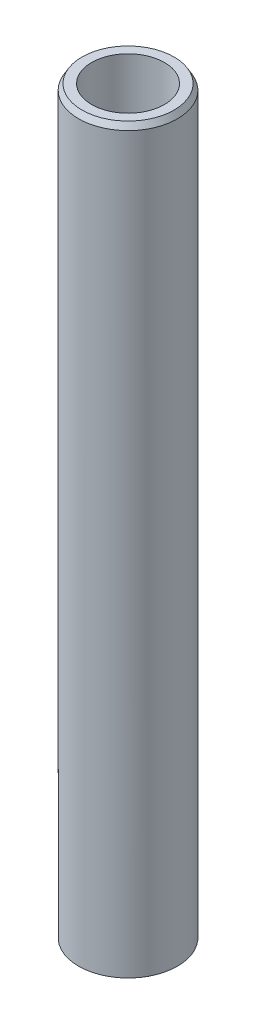
ISO-10303-21;
HEADER;
FILE_DESCRIPTION(('STEP AP214'),'2;1');
FILE_NAME('part.step','',(''),(''),'','','');
FILE_SCHEMA(('AUTOMOTIVE_DESIGN { 1 0 10303 214 1 1 1 1 }'));
ENDSEC;
DATA;
#1=APPLICATION_CONTEXT('core data for automotive mechanical design processes');
#2=APPLICATION_PROTOCOL_DEFINITION('international standard','automotive_design',2000,#1);
#3=PRODUCT_CONTEXT('',#1,'mechanical');
#4=PRODUCT('Part','Part','',(#3));
#5=PRODUCT_RELATED_PRODUCT_CATEGORY('part','',(#4));
#6=PRODUCT_DEFINITION_FORMATION('','',#4);
#7=PRODUCT_DEFINITION_CONTEXT('part definition',#1,'design');
#8=PRODUCT_DEFINITION('design','',#6,#7);
#9=PRODUCT_DEFINITION_SHAPE('','',#8);
#10=(LENGTH_UNIT() NAMED_UNIT(*) SI_UNIT(.MILLI.,.METRE.));
#11=(NAMED_UNIT(*) PLANE_ANGLE_UNIT() SI_UNIT($,.RADIAN.));
#12=(NAMED_UNIT(*) SI_UNIT($,.STERADIAN.) SOLID_ANGLE_UNIT());
#13=UNCERTAINTY_MEASURE_WITH_UNIT(LENGTH_MEASURE(1.E-05),#10,'distance_accuracy_value','');
#14=(GEOMETRIC_REPRESENTATION_CONTEXT(3) GLOBAL_UNCERTAINTY_ASSIGNED_CONTEXT((#13)) GLOBAL_UNIT_ASSIGNED_CONTEXT((#10,
#11,#12)) REPRESENTATION_CONTEXT('',''));
#15=CARTESIAN_POINT('',(0.,0.,0.));
#16=DIRECTION('',(0.,0.,1.));
#17=DIRECTION('',(1.,0.,0.));
#18=AXIS2_PLACEMENT_3D('',#15,#16,#17);
#19=CARTESIAN_POINT('',(0.,375.960972460126,0.));
#20=DIRECTION('',(0.,-1.,0.));
#21=DIRECTION('',(0.,0.,-1.));
#22=AXIS2_PLACEMENT_3D('',#19,#20,#21);
#23=CYLINDRICAL_SURFACE('',#22,25.);
#24=CARTESIAN_POINT('',(0.,372.987151396493,0.));
#25=DIRECTION('',(0.,1.,0.));
#26=DIRECTION('',(0.,0.,1.));
#27=AXIS2_PLACEMENT_3D('',#24,#25,#26);
#28=CIRCLE('',#27,25.);
#29=CARTESIAN_POINT('',(0.,372.987151396493,-25.));
#30=VERTEX_POINT('',#29);
#31=EDGE_CURVE('E50',#30,#30,#28,.F.);
#32=CARTESIAN_POINT('',(0.,1.71693639161058,0.));
#33=DIRECTION('',(0.,1.,0.));
#34=DIRECTION('',(0.,0.,1.));
#35=AXIS2_PLACEMENT_3D('',#32,#33,#34);
#36=CIRCLE('',#35,25.);
#37=CARTESIAN_POINT('',(0.,1.71693639161058,-25.));
#38=VERTEX_POINT('',#37);
#39=EDGE_CURVE('E51',#38,#38,#36,.T.);
#40=CARTESIAN_POINT('',(0.,372.987151396493,-25.));
#41=CARTESIAN_POINT('',(0.,369.119753323525,-25.));
#42=CARTESIAN_POINT('',(0.,365.252355250558,-25.));
#43=CARTESIAN_POINT('',(0.,357.517559104623,-25.));
#44=CARTESIAN_POINT('',(0.,353.650161031655,-25.));
#45=CARTESIAN_POINT('',(0.,345.91536488572,-25.));
#46=CARTESIAN_POINT('',(0.,342.047966812752,-25.));
#47=CARTESIAN_POINT('',(0.,334.313170666817,-25.));
#48=CARTESIAN_POINT('',(0.,330.44577259385,-25.));
#49=CARTESIAN_POINT('',(0.,322.710976447915,-25.));
#50=CARTESIAN_POINT('',(0.,318.843578374947,-25.));
#51=CARTESIAN_POINT('',(0.,311.108782229012,-25.));
#52=CARTESIAN_POINT('',(0.,307.241384156045,-25.));
#53=CARTESIAN_POINT('',(0.,299.50658801011,-25.));
#54=CARTESIAN_POINT('',(0.,295.639189937142,-25.));
#55=CARTESIAN_POINT('',(0.,287.904393791207,-25.));
#56=CARTESIAN_POINT('',(0.,284.03699571824,-25.));
#57=CARTESIAN_POINT('',(0.,276.302199572305,-25.));
#58=CARTESIAN_POINT('',(0.,272.434801499337,-25.));
#59=CARTESIAN_POINT('',(0.,264.700005353402,-25.));
#60=CARTESIAN_POINT('',(0.,260.832607280435,-25.));
#61=CARTESIAN_POINT('',(0.,253.097811134499,-25.));
#62=CARTESIAN_POINT('',(0.,249.230413061532,-25.));
#63=CARTESIAN_POINT('',(0.,241.495616915597,-25.));
#64=CARTESIAN_POINT('',(0.,237.628218842629,-25.));
#65=CARTESIAN_POINT('',(0.,229.893422696694,-25.));
#66=CARTESIAN_POINT('',(0.,226.026024623727,-25.));
#67=CARTESIAN_POINT('',(0.,218.291228477792,-25.));
#68=CARTESIAN_POINT('',(0.,214.423830404824,-25.));
#69=CARTESIAN_POINT('',(0.,206.689034258889,-25.));
#70=CARTESIAN_POINT('',(0.,202.821636185922,-25.));
#71=CARTESIAN_POINT('',(0.,195.086840039987,-25.));
#72=CARTESIAN_POINT('',(0.,191.219441967019,-25.));
#73=CARTESIAN_POINT('',(0.,183.484645821084,-25.));
#74=CARTESIAN_POINT('',(0.,179.617247748117,-25.));
#75=CARTESIAN_POINT('',(0.,171.882451602182,-25.));
#76=CARTESIAN_POINT('',(0.,168.015053529214,-25.));
#77=CARTESIAN_POINT('',(0.,160.280257383279,-25.));
#78=CARTESIAN_POINT('',(0.,156.412859310311,-25.));
#79=CARTESIAN_POINT('',(0.,148.678063164376,-25.));
#80=CARTESIAN_POINT('',(0.,144.810665091409,-25.));
#81=CARTESIAN_POINT('',(0.,137.075868945474,-25.));
#82=CARTESIAN_POINT('',(0.,133.208470872506,-25.));
#83=CARTESIAN_POINT('',(0.,125.473674726571,-25.));
#84=CARTESIAN_POINT('',(0.,121.606276653604,-25.));
#85=CARTESIAN_POINT('',(0.,113.871480507669,-25.));
#86=CARTESIAN_POINT('',(0.,110.004082434701,-25.));
#87=CARTESIAN_POINT('',(0.,102.269286288766,-25.));
#88=CARTESIAN_POINT('',(0.,98.4018882157986,-25.));
#89=CARTESIAN_POINT('',(0.,90.6670920698636,-25.));
#90=CARTESIAN_POINT('',(0.,86.7996939968961,-25.));
#91=CARTESIAN_POINT('',(0.,79.064897850961,-25.));
#92=CARTESIAN_POINT('',(0.,75.1974997779935,-25.));
#93=CARTESIAN_POINT('',(0.,67.4627036320584,-25.));
#94=CARTESIAN_POINT('',(0.,63.5953055590909,-25.));
#95=CARTESIAN_POINT('',(0.,55.8605094131559,-25.));
#96=CARTESIAN_POINT('',(0.,51.9931113401883,-25.));
#97=CARTESIAN_POINT('',(0.,44.2583151942533,-25.));
#98=CARTESIAN_POINT('',(0.,40.3909171212858,-25.));
#99=CARTESIAN_POINT('',(0.,32.6561209753508,-25.));
#100=CARTESIAN_POINT('',(0.,28.7887229023832,-25.));
#101=CARTESIAN_POINT('',(0.,21.0539267564482,-25.));
#102=CARTESIAN_POINT('',(0.,17.1865286834807,-25.));
#103=CARTESIAN_POINT('',(0.,9.45173253754563,-25.));
#104=CARTESIAN_POINT('',(0.,5.5843344645781,-25.));
#105=CARTESIAN_POINT('',(0.,1.71693639161058,-25.));
#106=B_SPLINE_CURVE_WITH_KNOTS('',3,(#40,#41,#42,#43,#44,#45,#46,#47,#48,#49,#50,#51,#52,#53,
#54,#55,#56,#57,#58,#59,#60,#61,#62,#63,#64,#65,#66,#67,#68,#69,#70,#71,#72,#73,#74,#75,#76,#77,
#78,#79,#80,#81,#82,#83,#84,#85,#86,#87,#88,#89,#90,#91,#92,#93,#94,#95,#96,#97,#98,#99,#100,
#101,#102,#103,#104,#105),.UNSPECIFIED.,.F.,.F.,(4,2,2,2,2,2,2,2,2,2,2,2,2,2,2,2,2,2,2,2,2,2,2,
2,2,2,2,2,2,2,2,2,4),(0.,11.6021942189025,23.2043884378051,34.8065826567077,46.4087768756102,
58.0109710945128,69.6131653134153,81.2153595323179,92.8175537512205,104.419747970123,
116.021942189026,127.624136407928,139.226330626831,150.828524845733,162.430719064636,
174.032913283538,185.635107502441,197.237301721344,208.839495940246,220.441690159149,
232.043884378051,243.646078596954,255.248272815856,266.850467034759,278.452661253661,
290.054855472564,301.657049691467,313.259243910369,324.861438129272,336.463632348174,
348.065826567077,359.668020785979,371.270215004882),.UNSPECIFIED.);
#107=EDGE_CURVE('BSEAM39',#30,#38,#106,.T.);
#108=ORIENTED_EDGE('',*,*,#31,.T.);
#109=ORIENTED_EDGE('',*,*,#39,.T.);
#110=ORIENTED_EDGE('',*,*,#107,.T.);
#111=ORIENTED_EDGE('',*,*,#107,.F.);
#112=EDGE_LOOP('',(#108,#110,#109,#111));
#113=FACE_BOUND('',#112,.T.);
#114=ADVANCED_FACE('F39',(#113),#23,.T.);
#115=CARTESIAN_POINT('',(0.,375.960972460126,0.));
#116=DIRECTION('',(0.,1.,0.));
#117=DIRECTION('',(0.,0.,1.));
#118=AXIS2_PLACEMENT_3D('',#115,#116,#117);
#119=PLANE('',#118);
#120=CARTESIAN_POINT('',(0.,375.960972460126,0.));
#121=DIRECTION('',(0.,1.,0.));
#122=DIRECTION('',(0.,0.,1.));
#123=AXIS2_PLACEMENT_3D('',#120,#121,#122);
#124=CIRCLE('',#123,23.2830636083897);
#125=CARTESIAN_POINT('',(0.,375.960972460126,23.2830636083897));
#126=VERTEX_POINT('',#125);
#127=EDGE_CURVE('E54',#126,#126,#124,.T.);
#128=ORIENTED_EDGE('',*,*,#127,.T.);
#129=EDGE_LOOP('',(#128));
#130=FACE_BOUND('',#129,.T.);
#131=CARTESIAN_POINT('',(0.,375.960972460126,0.));
#132=DIRECTION('',(0.,1.,0.));
#133=DIRECTION('',(0.,0.,1.));
#134=AXIS2_PLACEMENT_3D('',#131,#132,#133);
#135=CIRCLE('',#134,18.4327751660561);
#136=CARTESIAN_POINT('',(0.,375.960972460126,-18.4327751660561));
#137=VERTEX_POINT('',#136);
#138=EDGE_CURVE('E58',#137,#137,#135,.T.);
#139=ORIENTED_EDGE('',*,*,#138,.F.);
#140=EDGE_LOOP('',(#139));
#141=FACE_BOUND('',#140,.T.);
#142=ADVANCED_FACE('F69',(#130,#141),#119,.T.);
#143=CARTESIAN_POINT('',(0.,0.,0.));
#144=DIRECTION('',(0.,1.,0.));
#145=DIRECTION('',(0.,0.,1.));
#146=AXIS2_PLACEMENT_3D('',#143,#144,#145);
#147=PLANE('',#146);
#148=CARTESIAN_POINT('',(0.,0.,0.));
#149=DIRECTION('',(0.,1.,0.));
#150=DIRECTION('',(0.,0.,1.));
#151=AXIS2_PLACEMENT_3D('',#148,#149,#150);
#152=CIRCLE('',#151,22.0261789363664);
#153=CARTESIAN_POINT('',(0.,0.,22.0261789363664));
#154=VERTEX_POINT('',#153);
#155=EDGE_CURVE('E10',#154,#154,#152,.F.);
#156=ORIENTED_EDGE('',*,*,#155,.T.);
#157=EDGE_LOOP('',(#156));
#158=FACE_BOUND('',#157,.T.);
#159=CARTESIAN_POINT('',(0.,0.,0.));
#160=DIRECTION('',(0.,1.,0.));
#161=DIRECTION('',(0.,0.,1.));
#162=AXIS2_PLACEMENT_3D('',#159,#160,#161);
#163=CIRCLE('',#162,18.4327751660561);
#164=CARTESIAN_POINT('',(0.,0.,-18.4327751660561));
#165=VERTEX_POINT('',#164);
#166=EDGE_CURVE('E63',#165,#165,#163,.T.);
#167=ORIENTED_EDGE('',*,*,#166,.T.);
#168=EDGE_LOOP('',(#167));
#169=FACE_BOUND('',#168,.T.);
#170=ADVANCED_FACE('F75',(#158,#169),#147,.F.);
#171=CARTESIAN_POINT('',(0.,375.960972460126,0.));
#172=DIRECTION('',(0.,-1.,0.));
#173=DIRECTION('',(0.,0.,-1.));
#174=AXIS2_PLACEMENT_3D('',#171,#172,#173);
#175=CYLINDRICAL_SURFACE('',#174,18.4327751660561);
#176=CARTESIAN_POINT('',(0.,375.960972460126,-18.4327751660561));
#177=CARTESIAN_POINT('',(0.,372.044712330333,-18.4327751660561));
#178=CARTESIAN_POINT('',(0.,368.12845220054,-18.4327751660561));
#179=CARTESIAN_POINT('',(0.,360.295931940954,-18.4327751660561));
#180=CARTESIAN_POINT('',(0.,356.379671811161,-18.4327751660561));
#181=CARTESIAN_POINT('',(0.,348.547151551575,-18.4327751660561));
#182=CARTESIAN_POINT('',(0.,344.630891421782,-18.4327751660561));
#183=CARTESIAN_POINT('',(0.,336.798371162196,-18.4327751660561));
#184=CARTESIAN_POINT('',(0.,332.882111032403,-18.4327751660561));
#185=CARTESIAN_POINT('',(0.,325.049590772817,-18.4327751660561));
#186=CARTESIAN_POINT('',(0.,321.133330643024,-18.4327751660561));
#187=CARTESIAN_POINT('',(0.,313.300810383438,-18.4327751660561));
#188=CARTESIAN_POINT('',(0.,309.384550253645,-18.4327751660561));
#189=CARTESIAN_POINT('',(0.,301.552029994059,-18.4327751660561));
#190=CARTESIAN_POINT('',(0.,297.635769864266,-18.4327751660561));
#191=CARTESIAN_POINT('',(0.,289.80324960468,-18.4327751660561));
#192=CARTESIAN_POINT('',(0.,285.886989474887,-18.4327751660561));
#193=CARTESIAN_POINT('',(0.,278.054469215301,-18.4327751660561));
#194=CARTESIAN_POINT('',(0.,274.138209085508,-18.4327751660561));
#195=CARTESIAN_POINT('',(0.,266.305688825922,-18.4327751660561));
#196=CARTESIAN_POINT('',(0.,262.389428696129,-18.4327751660561));
#197=CARTESIAN_POINT('',(0.,254.556908436543,-18.4327751660561));
#198=CARTESIAN_POINT('',(0.,250.64064830675,-18.4327751660561));
#199=CARTESIAN_POINT('',(0.,242.808128047164,-18.4327751660561));
#200=CARTESIAN_POINT('',(0.,238.891867917371,-18.4327751660561));
#201=CARTESIAN_POINT('',(0.,231.059347657785,-18.4327751660561));
#202=CARTESIAN_POINT('',(0.,227.143087527993,-18.4327751660561));
#203=CARTESIAN_POINT('',(0.,219.310567268407,-18.4327751660561));
#204=CARTESIAN_POINT('',(0.,215.394307138614,-18.4327751660561));
#205=CARTESIAN_POINT('',(0.,207.561786879028,-18.4327751660561));
#206=CARTESIAN_POINT('',(0.,203.645526749235,-18.4327751660561));
#207=CARTESIAN_POINT('',(0.,195.813006489649,-18.4327751660561));
#208=CARTESIAN_POINT('',(0.,191.896746359856,-18.4327751660561));
#209=CARTESIAN_POINT('',(0.,184.06422610027,-18.4327751660561));
#210=CARTESIAN_POINT('',(0.,180.147965970477,-18.4327751660561));
#211=CARTESIAN_POINT('',(0.,172.315445710891,-18.4327751660561));
#212=CARTESIAN_POINT('',(0.,168.399185581098,-18.4327751660561));
#213=CARTESIAN_POINT('',(0.,160.566665321512,-18.4327751660561));
#214=CARTESIAN_POINT('',(0.,156.650405191719,-18.4327751660561));
#215=CARTESIAN_POINT('',(0.,148.817884932133,-18.4327751660561));
#216=CARTESIAN_POINT('',(0.,144.90162480234,-18.4327751660561));
#217=CARTESIAN_POINT('',(0.,137.069104542754,-18.4327751660561));
#218=CARTESIAN_POINT('',(0.,133.152844412961,-18.4327751660561));
#219=CARTESIAN_POINT('',(0.,125.320324153375,-18.4327751660561));
#220=CARTESIAN_POINT('',(0.,121.404064023582,-18.4327751660561));
#221=CARTESIAN_POINT('',(0.,113.571543763996,-18.4327751660561));
#222=CARTESIAN_POINT('',(0.,109.655283634203,-18.4327751660561));
#223=CARTESIAN_POINT('',(0.,101.822763374617,-18.4327751660561));
#224=CARTESIAN_POINT('',(0.,97.9065032448244,-18.4327751660561));
#225=CARTESIAN_POINT('',(0.,90.0739829852384,-18.4327751660561));
#226=CARTESIAN_POINT('',(0.,86.1577228554454,-18.4327751660561));
#227=CARTESIAN_POINT('',(0.,78.3252025958595,-18.4327751660561));
#228=CARTESIAN_POINT('',(0.,74.4089424660665,-18.4327751660561));
#229=CARTESIAN_POINT('',(0.,66.5764222064806,-18.4327751660561));
#230=CARTESIAN_POINT('',(0.,62.6601620766876,-18.4327751660561));
#231=CARTESIAN_POINT('',(0.,54.8276418171016,-18.4327751660561));
#232=CARTESIAN_POINT('',(0.,50.9113816873087,-18.4327751660561));
#233=CARTESIAN_POINT('',(0.,43.0788614277227,-18.4327751660561));
#234=CARTESIAN_POINT('',(0.,39.1626012979297,-18.4327751660561));
#235=CARTESIAN_POINT('',(0.,31.3300810383438,-18.4327751660561));
#236=CARTESIAN_POINT('',(0.,27.4138209085508,-18.4327751660561));
#237=CARTESIAN_POINT('',(0.,19.5813006489648,-18.4327751660561));
#238=CARTESIAN_POINT('',(0.,15.6650405191719,-18.4327751660561));
#239=CARTESIAN_POINT('',(0.,7.8325202595859,-18.4327751660561));
#240=CARTESIAN_POINT('',(0.,3.91626012979292,-18.4327751660561));
#241=CARTESIAN_POINT('',(0.,0.,-18.4327751660561));
#242=B_SPLINE_CURVE_WITH_KNOTS('',3,(#176,#177,#178,#179,#180,#181,#182,#183,#184,#185,#186,
#187,#188,#189,#190,#191,#192,#193,#194,#195,#196,#197,#198,#199,#200,#201,#202,#203,#204,#205,
#206,#207,#208,#209,#210,#211,#212,#213,#214,#215,#216,#217,#218,#219,#220,#221,#222,#223,#224,
#225,#226,#227,#228,#229,#230,#231,#232,#233,#234,#235,#236,#237,#238,#239,#240,#241),
.UNSPECIFIED.,.F.,.F.,(4,2,2,2,2,2,2,2,2,2,2,2,2,2,2,2,2,2,2,2,2,2,2,2,2,2,2,2,2,2,2,2,4),(0.,
11.7487803893789,23.4975607787579,35.2463411681368,46.9951215575157,58.7439019468947,
70.4926823362736,82.2414627256525,93.9902431150315,105.73902350441,117.487803893789,
129.236584283168,140.985364672547,152.734145061926,164.482925451305,176.231705840684,
187.980486230063,199.729266619442,211.478047008821,223.2268273982,234.975607787579,
246.724388176957,258.473168566336,270.221948955715,281.970729345094,293.719509734473,
305.468290123852,317.217070513231,328.96585090261,340.714631291989,352.463411681368,
364.212192070747,375.960972460126),.UNSPECIFIED.);
#243=EDGE_CURVE('BSEAM70',#137,#165,#242,.T.);
#244=ORIENTED_EDGE('',*,*,#138,.T.);
#245=ORIENTED_EDGE('',*,*,#166,.F.);
#246=ORIENTED_EDGE('',*,*,#243,.T.);
#247=ORIENTED_EDGE('',*,*,#243,.F.);
#248=EDGE_LOOP('',(#244,#246,#245,#247));
#249=FACE_BOUND('',#248,.T.);
#250=ADVANCED_FACE('F70',(#249),#175,.F.);
#251=CARTESIAN_POINT('',(0.,375.960972460126,0.));
#252=DIRECTION('',(0.,-1.,0.));
#253=DIRECTION('',(0.,0.,-1.));
#254=AXIS2_PLACEMENT_3D('',#251,#252,#253);
#255=CONICAL_SURFACE('',#254,23.2830636083897,0.523598775598301);
#256=ORIENTED_EDGE('',*,*,#31,.F.);
#257=EDGE_LOOP('',(#256));
#258=FACE_BOUND('',#257,.T.);
#259=ORIENTED_EDGE('',*,*,#127,.F.);
#260=EDGE_LOOP('',(#259));
#261=FACE_BOUND('',#260,.T.);
#262=ADVANCED_FACE('F81',(#258,#261),#255,.T.);
#263=CARTESIAN_POINT('',(0.,1.71693639161058,0.));
#264=DIRECTION('',(0.,1.,0.));
#265=DIRECTION('',(0.,0.,1.));
#266=AXIS2_PLACEMENT_3D('',#263,#264,#265);
#267=CONICAL_SURFACE('',#266,25.,1.04719755119661);
#268=ORIENTED_EDGE('',*,*,#155,.F.);
#269=EDGE_LOOP('',(#268));
#270=FACE_BOUND('',#269,.T.);
#271=ORIENTED_EDGE('',*,*,#39,.F.);
#272=EDGE_LOOP('',(#271));
#273=FACE_BOUND('',#272,.T.);
#274=ADVANCED_FACE('F45',(#270,#273),#267,.T.);
#275=CLOSED_SHELL('',(#114,#142,#170,#250,#262,#274));
#276=MANIFOLD_SOLID_BREP('B2',#275);
#277=ADVANCED_BREP_SHAPE_REPRESENTATION('',(#18,#276),#14);
#278=SHAPE_DEFINITION_REPRESENTATION(#9,#277);
ENDSEC;
END-ISO-10303-21;
